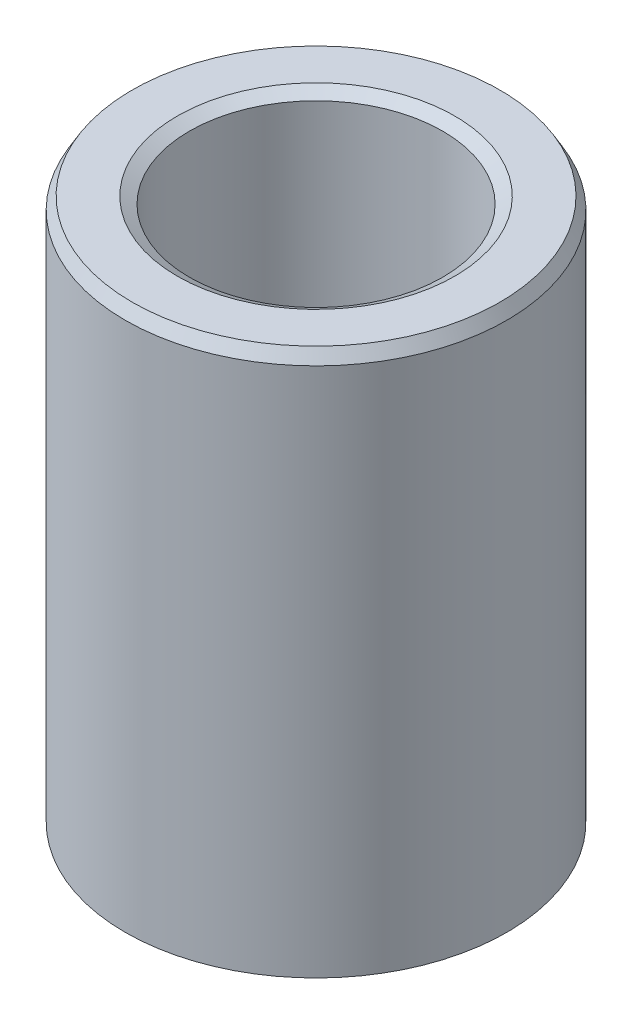
ISO-10303-21;
HEADER;
FILE_DESCRIPTION(('STEP AP214'),'2;1');
FILE_NAME('part.step','',(''),(''),'','','');
FILE_SCHEMA(('AUTOMOTIVE_DESIGN { 1 0 10303 214 1 1 1 1 }'));
ENDSEC;
DATA;
#1=APPLICATION_CONTEXT('core data for automotive mechanical design processes');
#2=APPLICATION_PROTOCOL_DEFINITION('international standard','automotive_design',2000,#1);
#3=PRODUCT_CONTEXT('',#1,'mechanical');
#4=PRODUCT('Part','Part','',(#3));
#5=PRODUCT_RELATED_PRODUCT_CATEGORY('part','',(#4));
#6=PRODUCT_DEFINITION_FORMATION('','',#4);
#7=PRODUCT_DEFINITION_CONTEXT('part definition',#1,'design');
#8=PRODUCT_DEFINITION('design','',#6,#7);
#9=PRODUCT_DEFINITION_SHAPE('','',#8);
#10=(LENGTH_UNIT() NAMED_UNIT(*) SI_UNIT(.MILLI.,.METRE.));
#11=(NAMED_UNIT(*) PLANE_ANGLE_UNIT() SI_UNIT($,.RADIAN.));
#12=(NAMED_UNIT(*) SI_UNIT($,.STERADIAN.) SOLID_ANGLE_UNIT());
#13=UNCERTAINTY_MEASURE_WITH_UNIT(LENGTH_MEASURE(1.E-05),#10,'distance_accuracy_value','');
#14=(GEOMETRIC_REPRESENTATION_CONTEXT(3) GLOBAL_UNCERTAINTY_ASSIGNED_CONTEXT((#13)) GLOBAL_UNIT_ASSIGNED_CONTEXT((#10,
#11,#12)) REPRESENTATION_CONTEXT('',''));
#15=CARTESIAN_POINT('',(0.,0.,0.));
#16=DIRECTION('',(0.,0.,1.));
#17=DIRECTION('',(1.,0.,0.));
#18=AXIS2_PLACEMENT_3D('',#15,#16,#17);
#19=CARTESIAN_POINT('',(0.,93.5356838299298,0.));
#20=DIRECTION('',(0.,-1.,0.));
#21=DIRECTION('',(0.,0.,-1.));
#22=AXIS2_PLACEMENT_3D('',#19,#20,#21);
#23=CYLINDRICAL_SURFACE('',#22,32.5);
#24=CARTESIAN_POINT('',(0.,1.19306103816262,0.));
#25=DIRECTION('',(0.,1.,0.));
#26=DIRECTION('',(0.,0.,1.));
#27=AXIS2_PLACEMENT_3D('',#24,#25,#26);
#28=CIRCLE('',#27,32.5);
#29=CARTESIAN_POINT('',(0.,1.19306103816262,32.5));
#30=VERTEX_POINT('',#29);
#31=EDGE_CURVE('E10',#30,#30,#28,.T.);
#32=ORIENTED_EDGE('',*,*,#31,.T.);
#33=EDGE_LOOP('',(#32));
#34=FACE_BOUND('',#33,.T.);
#35=CARTESIAN_POINT('',(0.,91.4692414953012,0.));
#36=DIRECTION('',(0.,1.,0.));
#37=DIRECTION('',(0.,0.,1.));
#38=AXIS2_PLACEMENT_3D('',#35,#36,#37);
#39=CIRCLE('',#38,32.5);
#40=CARTESIAN_POINT('',(0.,91.4692414953012,32.5));
#41=VERTEX_POINT('',#40);
#42=EDGE_CURVE('E50',#41,#41,#39,.F.);
#43=ORIENTED_EDGE('',*,*,#42,.T.);
#44=EDGE_LOOP('',(#43));
#45=FACE_BOUND('',#44,.T.);
#46=ADVANCED_FACE('F39',(#34,#45),#23,.T.);
#47=CARTESIAN_POINT('',(0.,93.5356838299298,0.));
#48=DIRECTION('',(0.,1.,0.));
#49=DIRECTION('',(0.,0.,1.));
#50=AXIS2_PLACEMENT_3D('',#47,#48,#49);
#51=PLANE('',#50);
#52=CARTESIAN_POINT('',(0.,93.5356838299298,0.));
#53=DIRECTION('',(0.,1.,0.));
#54=DIRECTION('',(0.,0.,1.));
#55=AXIS2_PLACEMENT_3D('',#52,#53,#54);
#56=CIRCLE('',#55,23.6324996860277);
#57=CARTESIAN_POINT('',(0.,93.5356838299298,23.6324996860277));
#58=VERTEX_POINT('',#57);
#59=EDGE_CURVE('E58',#58,#58,#56,.F.);
#60=ORIENTED_EDGE('',*,*,#59,.T.);
#61=EDGE_LOOP('',(#60));
#62=FACE_BOUND('',#61,.T.);
#63=CARTESIAN_POINT('',(0.,93.5356838299298,0.));
#64=DIRECTION('',(0.,1.,0.));
#65=DIRECTION('',(0.,0.,1.));
#66=AXIS2_PLACEMENT_3D('',#63,#64,#65);
#67=CIRCLE('',#66,31.3069389618374);
#68=CARTESIAN_POINT('',(0.,93.5356838299298,31.3069389618374));
#69=VERTEX_POINT('',#68);
#70=EDGE_CURVE('E61',#69,#69,#67,.T.);
#71=ORIENTED_EDGE('',*,*,#70,.T.);
#72=EDGE_LOOP('',(#71));
#73=FACE_BOUND('',#72,.T.);
#74=ADVANCED_FACE('F88',(#62,#73),#51,.T.);
#75=CARTESIAN_POINT('',(0.,0.,0.));
#76=DIRECTION('',(0.,1.,0.));
#77=DIRECTION('',(0.,0.,1.));
#78=AXIS2_PLACEMENT_3D('',#75,#76,#77);
#79=PLANE('',#78);
#80=CARTESIAN_POINT('',(0.,0.,0.));
#81=DIRECTION('',(0.,1.,0.));
#82=DIRECTION('',(0.,0.,1.));
#83=AXIS2_PLACEMENT_3D('',#80,#81,#82);
#84=CIRCLE('',#83,22.7591183895618);
#85=CARTESIAN_POINT('',(0.,0.,22.7591183895618));
#86=VERTEX_POINT('',#85);
#87=EDGE_CURVE('E51',#86,#86,#84,.T.);
#88=ORIENTED_EDGE('',*,*,#87,.T.);
#89=EDGE_LOOP('',(#88));
#90=FACE_BOUND('',#89,.T.);
#91=CARTESIAN_POINT('',(0.,0.,0.));
#92=DIRECTION('',(0.,1.,0.));
#93=DIRECTION('',(0.,0.,1.));
#94=AXIS2_PLACEMENT_3D('',#91,#92,#93);
#95=CIRCLE('',#94,30.4335576653715);
#96=CARTESIAN_POINT('',(0.,0.,30.4335576653715));
#97=VERTEX_POINT('',#96);
#98=EDGE_CURVE('E54',#97,#97,#95,.F.);
#99=ORIENTED_EDGE('',*,*,#98,.T.);
#100=EDGE_LOOP('',(#99));
#101=FACE_BOUND('',#100,.T.);
#102=ADVANCED_FACE('F83',(#90,#101),#79,.F.);
#103=CARTESIAN_POINT('',(0.,93.5356838299298,0.));
#104=DIRECTION('',(0.,-1.,0.));
#105=DIRECTION('',(0.,0.,-1.));
#106=AXIS2_PLACEMENT_3D('',#103,#104,#105);
#107=CYLINDRICAL_SURFACE('',#106,21.5660573513992);
#108=CARTESIAN_POINT('',(0.,92.3426227917672,0.));
#109=DIRECTION('',(0.,1.,0.));
#110=DIRECTION('',(0.,0.,1.));
#111=AXIS2_PLACEMENT_3D('',#108,#109,#110);
#112=CIRCLE('',#111,21.5660573513992);
#113=CARTESIAN_POINT('',(0.,92.3426227917672,21.5660573513992));
#114=VERTEX_POINT('',#113);
#115=EDGE_CURVE('E67',#114,#114,#112,.T.);
#116=ORIENTED_EDGE('',*,*,#115,.T.);
#117=EDGE_LOOP('',(#116));
#118=FACE_BOUND('',#117,.T.);
#119=CARTESIAN_POINT('',(0.,2.06644233462853,0.));
#120=DIRECTION('',(0.,1.,0.));
#121=DIRECTION('',(0.,0.,1.));
#122=AXIS2_PLACEMENT_3D('',#119,#120,#121);
#123=CIRCLE('',#122,21.5660573513992);
#124=CARTESIAN_POINT('',(0.,2.06644233462853,21.5660573513992));
#125=VERTEX_POINT('',#124);
#126=EDGE_CURVE('E69',#125,#125,#123,.F.);
#127=ORIENTED_EDGE('',*,*,#126,.T.);
#128=EDGE_LOOP('',(#127));
#129=FACE_BOUND('',#128,.T.);
#130=ADVANCED_FACE('F71',(#118,#129),#107,.F.);
#131=CARTESIAN_POINT('',(0.,92.3426227917672,0.));
#132=DIRECTION('',(0.,1.,0.));
#133=DIRECTION('',(0.,0.,1.));
#134=AXIS2_PLACEMENT_3D('',#131,#132,#133);
#135=CONICAL_SURFACE('',#134,21.5660573513992,1.0471975511966);
#136=ORIENTED_EDGE('',*,*,#59,.F.);
#137=EDGE_LOOP('',(#136));
#138=FACE_BOUND('',#137,.T.);
#139=ORIENTED_EDGE('',*,*,#115,.F.);
#140=EDGE_LOOP('',(#139));
#141=FACE_BOUND('',#140,.T.);
#142=ADVANCED_FACE('F77',(#138,#141),#135,.F.);
#143=CARTESIAN_POINT('',(0.,0.,0.));
#144=DIRECTION('',(0.,-1.,0.));
#145=DIRECTION('',(0.,0.,-1.));
#146=AXIS2_PLACEMENT_3D('',#143,#144,#145);
#147=CONICAL_SURFACE('',#146,22.7591183895618,0.523598775598296);
#148=ORIENTED_EDGE('',*,*,#126,.F.);
#149=EDGE_LOOP('',(#148));
#150=FACE_BOUND('',#149,.T.);
#151=ORIENTED_EDGE('',*,*,#87,.F.);
#152=EDGE_LOOP('',(#151));
#153=FACE_BOUND('',#152,.T.);
#154=ADVANCED_FACE('F73',(#150,#153),#147,.F.);
#155=CARTESIAN_POINT('',(0.,1.19306103816262,0.));
#156=DIRECTION('',(0.,1.,0.));
#157=DIRECTION('',(0.,0.,1.));
#158=AXIS2_PLACEMENT_3D('',#155,#156,#157);
#159=CONICAL_SURFACE('',#158,32.5,1.0471975511966);
#160=ORIENTED_EDGE('',*,*,#98,.F.);
#161=EDGE_LOOP('',(#160));
#162=FACE_BOUND('',#161,.T.);
#163=ORIENTED_EDGE('',*,*,#31,.F.);
#164=EDGE_LOOP('',(#163));
#165=FACE_BOUND('',#164,.T.);
#166=ADVANCED_FACE('F76',(#162,#165),#159,.T.);
#167=CARTESIAN_POINT('',(0.,93.5356838299298,0.));
#168=DIRECTION('',(0.,-1.,0.));
#169=DIRECTION('',(0.,0.,-1.));
#170=AXIS2_PLACEMENT_3D('',#167,#168,#169);
#171=CONICAL_SURFACE('',#170,31.3069389618374,0.523598775598295);
#172=ORIENTED_EDGE('',*,*,#42,.F.);
#173=EDGE_LOOP('',(#172));
#174=FACE_BOUND('',#173,.T.);
#175=ORIENTED_EDGE('',*,*,#70,.F.);
#176=EDGE_LOOP('',(#175));
#177=FACE_BOUND('',#176,.T.);
#178=ADVANCED_FACE('F45',(#174,#177),#171,.T.);
#179=CLOSED_SHELL('',(#46,#74,#102,#130,#142,#154,#166,#178));
#180=MANIFOLD_SOLID_BREP('B2',#179);
#181=ADVANCED_BREP_SHAPE_REPRESENTATION('',(#18,#180),#14);
#182=SHAPE_DEFINITION_REPRESENTATION(#9,#181);
ENDSEC;
END-ISO-10303-21;
